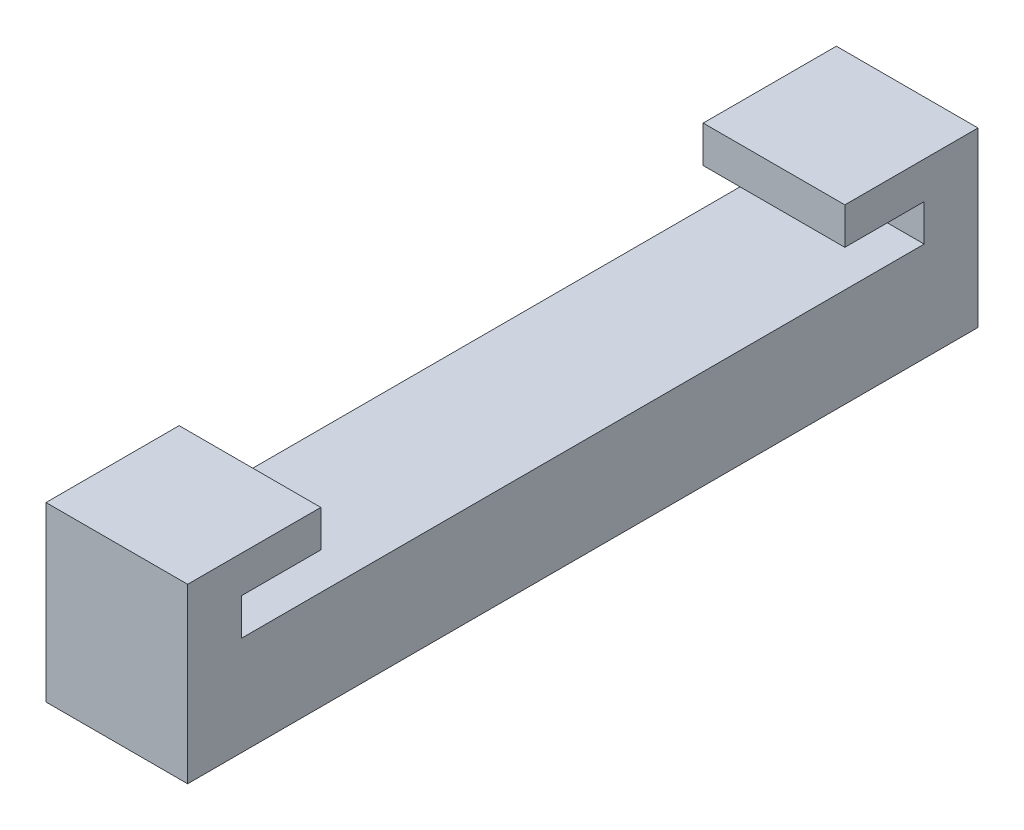
ISO-10303-21;
HEADER;
FILE_DESCRIPTION(('STEP AP214'),'2;1');
FILE_NAME('part.step','',(''),(''),'','','');
FILE_SCHEMA(('AUTOMOTIVE_DESIGN { 1 0 10303 214 1 1 1 1 }'));
ENDSEC;
DATA;
#1=APPLICATION_CONTEXT('core data for automotive mechanical design processes');
#2=APPLICATION_PROTOCOL_DEFINITION('international standard','automotive_design',2000,#1);
#3=PRODUCT_CONTEXT('',#1,'mechanical');
#4=PRODUCT('Part','Part','',(#3));
#5=PRODUCT_RELATED_PRODUCT_CATEGORY('part','',(#4));
#6=PRODUCT_DEFINITION_FORMATION('','',#4);
#7=PRODUCT_DEFINITION_CONTEXT('part definition',#1,'design');
#8=PRODUCT_DEFINITION('design','',#6,#7);
#9=PRODUCT_DEFINITION_SHAPE('','',#8);
#10=(LENGTH_UNIT() NAMED_UNIT(*) SI_UNIT(.MILLI.,.METRE.));
#11=(NAMED_UNIT(*) PLANE_ANGLE_UNIT() SI_UNIT($,.RADIAN.));
#12=(NAMED_UNIT(*) SI_UNIT($,.STERADIAN.) SOLID_ANGLE_UNIT());
#13=UNCERTAINTY_MEASURE_WITH_UNIT(LENGTH_MEASURE(1.E-05),#10,'distance_accuracy_value','');
#14=(GEOMETRIC_REPRESENTATION_CONTEXT(3) GLOBAL_UNCERTAINTY_ASSIGNED_CONTEXT((#13)) GLOBAL_UNIT_ASSIGNED_CONTEXT((#10,
#11,#12)) REPRESENTATION_CONTEXT('',''));
#15=CARTESIAN_POINT('',(0.,0.,0.));
#16=DIRECTION('',(0.,0.,1.));
#17=DIRECTION('',(1.,0.,0.));
#18=AXIS2_PLACEMENT_3D('',#15,#16,#17);
#19=CARTESIAN_POINT('',(12.7,12.192,-63.5));
#20=DIRECTION('',(0.,-1.,0.));
#21=DIRECTION('',(0.,0.,-1.));
#22=AXIS2_PLACEMENT_3D('',#19,#20,#21);
#23=PLANE('',#22);
#24=DIRECTION('',(-1.,0.,0.));
#25=VECTOR('',#24,1.);
#26=CARTESIAN_POINT('',(12.7,12.192,-70.612));
#27=LINE('',#26,#25);
#28=CARTESIAN_POINT('',(12.7,12.192,-70.612));
#29=VERTEX_POINT('',#28);
#30=CARTESIAN_POINT('',(0.,12.192,-70.612));
#31=VERTEX_POINT('',#30);
#32=EDGE_CURVE('E78',#29,#31,#27,.T.);
#33=ORIENTED_EDGE('',*,*,#32,.F.);
#34=DIRECTION('',(0.,0.,1.));
#35=VECTOR('',#34,1.);
#36=CARTESIAN_POINT('',(12.7,12.192,-63.5));
#37=LINE('',#36,#35);
#38=CARTESIAN_POINT('',(12.7,12.192,-63.5));
#39=VERTEX_POINT('',#38);
#40=EDGE_CURVE('E226',#29,#39,#37,.T.);
#41=ORIENTED_EDGE('',*,*,#40,.T.);
#42=DIRECTION('',(-1.,0.,0.));
#43=VECTOR('',#42,1.);
#44=CARTESIAN_POINT('',(12.7,12.192,-63.5));
#45=LINE('',#44,#43);
#46=CARTESIAN_POINT('',(0.,12.192,-63.5));
#47=VERTEX_POINT('',#46);
#48=EDGE_CURVE('E90',#39,#47,#45,.T.);
#49=ORIENTED_EDGE('',*,*,#48,.T.);
#50=DIRECTION('',(0.,0.,1.));
#51=VECTOR('',#50,1.);
#52=CARTESIAN_POINT('',(0.,12.192,-63.5));
#53=LINE('',#52,#51);
#54=EDGE_CURVE('E99',#31,#47,#53,.T.);
#55=ORIENTED_EDGE('',*,*,#54,.F.);
#56=EDGE_LOOP('',(#33,#41,#49,#55));
#57=FACE_BOUND('',#56,.T.);
#58=ADVANCED_FACE('F33',(#57),#23,.T.);
#59=CARTESIAN_POINT('',(12.7,8.89,-70.612));
#60=DIRECTION('',(0.,0.,1.));
#61=DIRECTION('',(1.,0.,0.));
#62=AXIS2_PLACEMENT_3D('',#59,#60,#61);
#63=PLANE('',#62);
#64=DIRECTION('',(-1.,0.,0.));
#65=VECTOR('',#64,1.);
#66=CARTESIAN_POINT('',(12.7,8.89,-70.612));
#67=LINE('',#66,#65);
#68=CARTESIAN_POINT('',(12.7,8.89,-70.612));
#69=VERTEX_POINT('',#68);
#70=CARTESIAN_POINT('',(0.,8.89,-70.612));
#71=VERTEX_POINT('',#70);
#72=EDGE_CURVE('E91',#69,#71,#67,.T.);
#73=ORIENTED_EDGE('',*,*,#72,.F.);
#74=DIRECTION('',(0.,1.,0.));
#75=VECTOR('',#74,1.);
#76=CARTESIAN_POINT('',(12.7,12.192,-70.612));
#77=LINE('',#76,#75);
#78=EDGE_CURVE('E85',#69,#29,#77,.T.);
#79=ORIENTED_EDGE('',*,*,#78,.T.);
#80=ORIENTED_EDGE('',*,*,#32,.T.);
#81=DIRECTION('',(0.,1.,0.));
#82=VECTOR('',#81,1.);
#83=CARTESIAN_POINT('',(0.,8.89,-70.612));
#84=LINE('',#83,#82);
#85=EDGE_CURVE('E82',#71,#31,#84,.T.);
#86=ORIENTED_EDGE('',*,*,#85,.F.);
#87=EDGE_LOOP('',(#73,#79,#80,#86));
#88=FACE_BOUND('',#87,.T.);
#89=ADVANCED_FACE('F81',(#88),#63,.T.);
#90=CARTESIAN_POINT('',(12.7,0.,0.));
#91=DIRECTION('',(0.,1.,0.));
#92=DIRECTION('',(0.,0.,1.));
#93=AXIS2_PLACEMENT_3D('',#90,#91,#92);
#94=PLANE('',#93);
#95=DIRECTION('',(0.,0.,-1.));
#96=VECTOR('',#95,1.);
#97=CARTESIAN_POINT('',(12.7,0.,0.));
#98=LINE('',#97,#96);
#99=CARTESIAN_POINT('',(12.7,0.,-4.572));
#100=VERTEX_POINT('',#99);
#101=CARTESIAN_POINT('',(12.7,0.,-75.438));
#102=VERTEX_POINT('',#101);
#103=EDGE_CURVE('E42',#100,#102,#98,.T.);
#104=ORIENTED_EDGE('',*,*,#103,.F.);
#105=DIRECTION('',(-1.,0.,0.));
#106=VECTOR('',#105,1.);
#107=CARTESIAN_POINT('',(12.701,0.,-4.572));
#108=LINE('',#107,#106);
#109=CARTESIAN_POINT('',(0.,0.,-4.572));
#110=VERTEX_POINT('',#109);
#111=EDGE_CURVE('E179',#100,#110,#108,.T.);
#112=ORIENTED_EDGE('',*,*,#111,.T.);
#113=DIRECTION('',(0.,0.,-1.));
#114=VECTOR('',#113,1.);
#115=CARTESIAN_POINT('',(0.,0.,0.));
#116=LINE('',#115,#114);
#117=CARTESIAN_POINT('',(0.,0.,-75.438));
#118=VERTEX_POINT('',#117);
#119=EDGE_CURVE('E109',#110,#118,#116,.T.);
#120=ORIENTED_EDGE('',*,*,#119,.T.);
#121=DIRECTION('',(-1.,0.,0.));
#122=VECTOR('',#121,1.);
#123=CARTESIAN_POINT('',(12.701,0.,-75.438));
#124=LINE('',#123,#122);
#125=EDGE_CURVE('E173',#102,#118,#124,.T.);
#126=ORIENTED_EDGE('',*,*,#125,.F.);
#127=EDGE_LOOP('',(#104,#112,#120,#126));
#128=FACE_BOUND('',#127,.T.);
#129=ADVANCED_FACE('F35',(#128),#94,.F.);
#130=CARTESIAN_POINT('',(12.7,8.89,-71.12));
#131=DIRECTION('',(0.,-1.,0.));
#132=DIRECTION('',(0.,0.,-1.));
#133=AXIS2_PLACEMENT_3D('',#130,#131,#132);
#134=PLANE('',#133);
#135=DIRECTION('',(0.,0.,1.));
#136=VECTOR('',#135,1.);
#137=CARTESIAN_POINT('',(12.7,8.89,-71.12));
#138=LINE('',#137,#136);
#139=CARTESIAN_POINT('',(12.7,8.88999999999999,-9.398));
#140=VERTEX_POINT('',#139);
#141=EDGE_CURVE('E11',#69,#140,#138,.T.);
#142=ORIENTED_EDGE('',*,*,#141,.F.);
#143=ORIENTED_EDGE('',*,*,#72,.T.);
#144=DIRECTION('',(0.,0.,1.));
#145=VECTOR('',#144,1.);
#146=CARTESIAN_POINT('',(0.,8.89,-71.12));
#147=LINE('',#146,#145);
#148=CARTESIAN_POINT('',(0.,8.88999999999999,-9.398));
#149=VERTEX_POINT('',#148);
#150=EDGE_CURVE('E37',#71,#149,#147,.T.);
#151=ORIENTED_EDGE('',*,*,#150,.T.);
#152=DIRECTION('',(-1.,0.,0.));
#153=VECTOR('',#152,1.);
#154=CARTESIAN_POINT('',(12.7,8.88999999999999,-9.398));
#155=LINE('',#154,#153);
#156=EDGE_CURVE('E50',#140,#149,#155,.T.);
#157=ORIENTED_EDGE('',*,*,#156,.F.);
#158=EDGE_LOOP('',(#142,#143,#151,#157));
#159=FACE_BOUND('',#158,.T.);
#160=ADVANCED_FACE('F123',(#159),#134,.F.);
#161=CARTESIAN_POINT('',(12.7,0.,0.));
#162=DIRECTION('',(1.,0.,0.));
#163=DIRECTION('',(0.,0.,-1.));
#164=AXIS2_PLACEMENT_3D('',#161,#162,#163);
#165=PLANE('',#164);
#166=ORIENTED_EDGE('',*,*,#78,.F.);
#167=ORIENTED_EDGE('',*,*,#141,.T.);
#168=DIRECTION('',(0.,-1.,0.));
#169=VECTOR('',#168,1.);
#170=CARTESIAN_POINT('',(12.7,12.192,-9.398));
#171=LINE('',#170,#169);
#172=CARTESIAN_POINT('',(12.7,12.192,-9.398));
#173=VERTEX_POINT('',#172);
#174=EDGE_CURVE('E232',#173,#140,#171,.T.);
#175=ORIENTED_EDGE('',*,*,#174,.F.);
#176=DIRECTION('',(0.,0.,1.));
#177=VECTOR('',#176,1.);
#178=CARTESIAN_POINT('',(12.7,12.192,-16.51));
#179=LINE('',#178,#177);
#180=CARTESIAN_POINT('',(12.7,12.192,-16.51));
#181=VERTEX_POINT('',#180);
#182=EDGE_CURVE('E228',#181,#173,#179,.T.);
#183=ORIENTED_EDGE('',*,*,#182,.F.);
#184=DIRECTION('',(0.,-1.,0.));
#185=VECTOR('',#184,1.);
#186=CARTESIAN_POINT('',(12.7,12.192,-16.51));
#187=LINE('',#186,#185);
#188=CARTESIAN_POINT('',(12.7,15.494,-16.51));
#189=VERTEX_POINT('',#188);
#190=EDGE_CURVE('E135',#189,#181,#187,.T.);
#191=ORIENTED_EDGE('',*,*,#190,.F.);
#192=DIRECTION('',(0.,0.,-1.));
#193=VECTOR('',#192,1.);
#194=CARTESIAN_POINT('',(12.7,15.494,-16.51));
#195=LINE('',#194,#193);
#196=CARTESIAN_POINT('',(12.7,15.494,-4.572));
#197=VERTEX_POINT('',#196);
#198=EDGE_CURVE('E151',#197,#189,#195,.T.);
#199=ORIENTED_EDGE('',*,*,#198,.F.);
#200=DIRECTION('',(0.,-1.,0.));
#201=VECTOR('',#200,1.);
#202=CARTESIAN_POINT('',(12.7,15.494,-4.572));
#203=LINE('',#202,#201);
#204=EDGE_CURVE('E234',#197,#100,#203,.T.);
#205=ORIENTED_EDGE('',*,*,#204,.T.);
#206=ORIENTED_EDGE('',*,*,#103,.T.);
#207=DIRECTION('',(0.,1.,0.));
#208=VECTOR('',#207,1.);
#209=CARTESIAN_POINT('',(12.7,15.494,-75.438));
#210=LINE('',#209,#208);
#211=CARTESIAN_POINT('',(12.7,15.494,-75.438));
#212=VERTEX_POINT('',#211);
#213=EDGE_CURVE('E176',#102,#212,#210,.T.);
#214=ORIENTED_EDGE('',*,*,#213,.T.);
#215=DIRECTION('',(0.,0.,-1.));
#216=VECTOR('',#215,1.);
#217=CARTESIAN_POINT('',(12.7,15.494,-63.5));
#218=LINE('',#217,#216);
#219=CARTESIAN_POINT('',(12.7,15.494,-63.5));
#220=VERTEX_POINT('',#219);
#221=EDGE_CURVE('E105',#220,#212,#218,.T.);
#222=ORIENTED_EDGE('',*,*,#221,.F.);
#223=DIRECTION('',(0.,1.,0.));
#224=VECTOR('',#223,1.);
#225=CARTESIAN_POINT('',(12.7,12.192,-63.5));
#226=LINE('',#225,#224);
#227=EDGE_CURVE('E59',#39,#220,#226,.T.);
#228=ORIENTED_EDGE('',*,*,#227,.F.);
#229=ORIENTED_EDGE('',*,*,#40,.F.);
#230=EDGE_LOOP('',(#166,#167,#175,#183,#191,#199,#205,#206,#214,#222,#228,#229));
#231=FACE_BOUND('',#230,.T.);
#232=ADVANCED_FACE('F225',(#231),#165,.T.);
#233=CARTESIAN_POINT('',(0.,0.,0.));
#234=DIRECTION('',(1.,0.,0.));
#235=DIRECTION('',(0.,0.,-1.));
#236=AXIS2_PLACEMENT_3D('',#233,#234,#235);
#237=PLANE('',#236);
#238=ORIENTED_EDGE('',*,*,#119,.F.);
#239=DIRECTION('',(0.,-1.,0.));
#240=VECTOR('',#239,1.);
#241=CARTESIAN_POINT('',(0.,15.494,-4.572));
#242=LINE('',#241,#240);
#243=CARTESIAN_POINT('',(0.,15.494,-4.572));
#244=VERTEX_POINT('',#243);
#245=EDGE_CURVE('E237',#244,#110,#242,.T.);
#246=ORIENTED_EDGE('',*,*,#245,.F.);
#247=DIRECTION('',(0.,0.,-1.));
#248=VECTOR('',#247,1.);
#249=CARTESIAN_POINT('',(0.,15.494,-16.51));
#250=LINE('',#249,#248);
#251=CARTESIAN_POINT('',(0.,15.494,-16.51));
#252=VERTEX_POINT('',#251);
#253=EDGE_CURVE('E132',#244,#252,#250,.T.);
#254=ORIENTED_EDGE('',*,*,#253,.T.);
#255=DIRECTION('',(0.,-1.,0.));
#256=VECTOR('',#255,1.);
#257=CARTESIAN_POINT('',(0.,12.192,-16.51));
#258=LINE('',#257,#256);
#259=CARTESIAN_POINT('',(0.,12.192,-16.51));
#260=VERTEX_POINT('',#259);
#261=EDGE_CURVE('E137',#252,#260,#258,.T.);
#262=ORIENTED_EDGE('',*,*,#261,.T.);
#263=DIRECTION('',(0.,0.,1.));
#264=VECTOR('',#263,1.);
#265=CARTESIAN_POINT('',(0.,12.192,-16.51));
#266=LINE('',#265,#264);
#267=CARTESIAN_POINT('',(0.,12.192,-9.398));
#268=VERTEX_POINT('',#267);
#269=EDGE_CURVE('E130',#260,#268,#266,.T.);
#270=ORIENTED_EDGE('',*,*,#269,.T.);
#271=DIRECTION('',(0.,-1.,0.));
#272=VECTOR('',#271,1.);
#273=CARTESIAN_POINT('',(0.,8.88999999999999,-9.398));
#274=LINE('',#273,#272);
#275=EDGE_CURVE('E126',#268,#149,#274,.T.);
#276=ORIENTED_EDGE('',*,*,#275,.T.);
#277=ORIENTED_EDGE('',*,*,#150,.F.);
#278=ORIENTED_EDGE('',*,*,#85,.T.);
#279=ORIENTED_EDGE('',*,*,#54,.T.);
#280=DIRECTION('',(0.,1.,0.));
#281=VECTOR('',#280,1.);
#282=CARTESIAN_POINT('',(0.,12.192,-63.5));
#283=LINE('',#282,#281);
#284=CARTESIAN_POINT('',(0.,15.494,-63.5));
#285=VERTEX_POINT('',#284);
#286=EDGE_CURVE('E144',#47,#285,#283,.T.);
#287=ORIENTED_EDGE('',*,*,#286,.T.);
#288=DIRECTION('',(0.,0.,-1.));
#289=VECTOR('',#288,1.);
#290=CARTESIAN_POINT('',(0.,15.494,-63.5));
#291=LINE('',#290,#289);
#292=CARTESIAN_POINT('',(0.,15.494,-75.438));
#293=VERTEX_POINT('',#292);
#294=EDGE_CURVE('E101',#285,#293,#291,.T.);
#295=ORIENTED_EDGE('',*,*,#294,.T.);
#296=DIRECTION('',(0.,1.,0.));
#297=VECTOR('',#296,1.);
#298=CARTESIAN_POINT('',(0.,15.494,-75.438));
#299=LINE('',#298,#297);
#300=EDGE_CURVE('E161',#118,#293,#299,.T.);
#301=ORIENTED_EDGE('',*,*,#300,.F.);
#302=EDGE_LOOP('',(#238,#246,#254,#262,#270,#276,#277,#278,#279,#287,#295,#301));
#303=FACE_BOUND('',#302,.T.);
#304=ADVANCED_FACE('F97',(#303),#237,.F.);
#305=CARTESIAN_POINT('',(12.7,15.494,-63.5));
#306=DIRECTION('',(0.,1.,0.));
#307=DIRECTION('',(0.,0.,1.));
#308=AXIS2_PLACEMENT_3D('',#305,#306,#307);
#309=PLANE('',#308);
#310=ORIENTED_EDGE('',*,*,#221,.T.);
#311=DIRECTION('',(-1.,0.,0.));
#312=VECTOR('',#311,1.);
#313=CARTESIAN_POINT('',(12.701,15.494,-75.438));
#314=LINE('',#313,#312);
#315=EDGE_CURVE('E166',#212,#293,#314,.T.);
#316=ORIENTED_EDGE('',*,*,#315,.T.);
#317=ORIENTED_EDGE('',*,*,#294,.F.);
#318=DIRECTION('',(-1.,0.,0.));
#319=VECTOR('',#318,1.);
#320=CARTESIAN_POINT('',(12.7,15.494,-63.5));
#321=LINE('',#320,#319);
#322=EDGE_CURVE('E112',#220,#285,#321,.T.);
#323=ORIENTED_EDGE('',*,*,#322,.F.);
#324=EDGE_LOOP('',(#310,#316,#317,#323));
#325=FACE_BOUND('',#324,.T.);
#326=ADVANCED_FACE('F167',(#325),#309,.T.);
#327=CARTESIAN_POINT('',(12.7,12.192,-63.5));
#328=DIRECTION('',(0.,0.,1.));
#329=DIRECTION('',(1.,0.,0.));
#330=AXIS2_PLACEMENT_3D('',#327,#328,#329);
#331=PLANE('',#330);
#332=ORIENTED_EDGE('',*,*,#48,.F.);
#333=ORIENTED_EDGE('',*,*,#227,.T.);
#334=ORIENTED_EDGE('',*,*,#322,.T.);
#335=ORIENTED_EDGE('',*,*,#286,.F.);
#336=EDGE_LOOP('',(#332,#333,#334,#335));
#337=FACE_BOUND('',#336,.T.);
#338=ADVANCED_FACE('F269',(#337),#331,.T.);
#339=CARTESIAN_POINT('',(12.7,15.494,-16.51));
#340=DIRECTION('',(0.,1.,0.));
#341=DIRECTION('',(0.,0.,1.));
#342=AXIS2_PLACEMENT_3D('',#339,#340,#341);
#343=PLANE('',#342);
#344=ORIENTED_EDGE('',*,*,#253,.F.);
#345=DIRECTION('',(-1.,0.,0.));
#346=VECTOR('',#345,1.);
#347=CARTESIAN_POINT('',(12.701,15.494,-4.572));
#348=LINE('',#347,#346);
#349=EDGE_CURVE('E239',#197,#244,#348,.T.);
#350=ORIENTED_EDGE('',*,*,#349,.F.);
#351=ORIENTED_EDGE('',*,*,#198,.T.);
#352=DIRECTION('',(-1.,0.,0.));
#353=VECTOR('',#352,1.);
#354=CARTESIAN_POINT('',(12.7,15.494,-16.51));
#355=LINE('',#354,#353);
#356=EDGE_CURVE('E141',#189,#252,#355,.T.);
#357=ORIENTED_EDGE('',*,*,#356,.T.);
#358=EDGE_LOOP('',(#344,#350,#351,#357));
#359=FACE_BOUND('',#358,.T.);
#360=ADVANCED_FACE('F246',(#359),#343,.T.);
#361=CARTESIAN_POINT('',(12.7,12.192,-16.51));
#362=DIRECTION('',(0.,0.,-1.));
#363=DIRECTION('',(-1.,0.,0.));
#364=AXIS2_PLACEMENT_3D('',#361,#362,#363);
#365=PLANE('',#364);
#366=ORIENTED_EDGE('',*,*,#190,.T.);
#367=DIRECTION('',(-1.,0.,0.));
#368=VECTOR('',#367,1.);
#369=CARTESIAN_POINT('',(12.7,12.192,-16.51));
#370=LINE('',#369,#368);
#371=EDGE_CURVE('E149',#181,#260,#370,.T.);
#372=ORIENTED_EDGE('',*,*,#371,.T.);
#373=ORIENTED_EDGE('',*,*,#261,.F.);
#374=ORIENTED_EDGE('',*,*,#356,.F.);
#375=EDGE_LOOP('',(#366,#372,#373,#374));
#376=FACE_BOUND('',#375,.T.);
#377=ADVANCED_FACE('F192',(#376),#365,.T.);
#378=CARTESIAN_POINT('',(12.7,8.88999999999999,-9.398));
#379=DIRECTION('',(0.,0.,-1.));
#380=DIRECTION('',(-1.,0.,0.));
#381=AXIS2_PLACEMENT_3D('',#378,#379,#380);
#382=PLANE('',#381);
#383=DIRECTION('',(-1.,0.,0.));
#384=VECTOR('',#383,1.);
#385=CARTESIAN_POINT('',(12.7,12.192,-9.398));
#386=LINE('',#385,#384);
#387=EDGE_CURVE('E146',#173,#268,#386,.T.);
#388=ORIENTED_EDGE('',*,*,#387,.F.);
#389=ORIENTED_EDGE('',*,*,#174,.T.);
#390=ORIENTED_EDGE('',*,*,#156,.T.);
#391=ORIENTED_EDGE('',*,*,#275,.F.);
#392=EDGE_LOOP('',(#388,#389,#390,#391));
#393=FACE_BOUND('',#392,.T.);
#394=ADVANCED_FACE('F251',(#393),#382,.T.);
#395=CARTESIAN_POINT('',(12.7,12.192,-16.51));
#396=DIRECTION('',(0.,-1.,0.));
#397=DIRECTION('',(0.,0.,-1.));
#398=AXIS2_PLACEMENT_3D('',#395,#396,#397);
#399=PLANE('',#398);
#400=ORIENTED_EDGE('',*,*,#371,.F.);
#401=ORIENTED_EDGE('',*,*,#182,.T.);
#402=ORIENTED_EDGE('',*,*,#387,.T.);
#403=ORIENTED_EDGE('',*,*,#269,.F.);
#404=EDGE_LOOP('',(#400,#401,#402,#403));
#405=FACE_BOUND('',#404,.T.);
#406=ADVANCED_FACE('F249',(#405),#399,.T.);
#407=CARTESIAN_POINT('',(12.701,15.494,-75.438));
#408=DIRECTION('',(0.,0.,1.));
#409=DIRECTION('',(1.,0.,0.));
#410=AXIS2_PLACEMENT_3D('',#407,#408,#409);
#411=PLANE('',#410);
#412=ORIENTED_EDGE('',*,*,#125,.T.);
#413=ORIENTED_EDGE('',*,*,#300,.T.);
#414=ORIENTED_EDGE('',*,*,#315,.F.);
#415=ORIENTED_EDGE('',*,*,#213,.F.);
#416=EDGE_LOOP('',(#412,#413,#414,#415));
#417=FACE_BOUND('',#416,.T.);
#418=ADVANCED_FACE('F175',(#417),#411,.F.);
#419=CARTESIAN_POINT('',(12.701,15.494,-4.572));
#420=DIRECTION('',(0.,0.,-1.));
#421=DIRECTION('',(0.,1.,0.));
#422=AXIS2_PLACEMENT_3D('',#419,#420,#421);
#423=PLANE('',#422);
#424=ORIENTED_EDGE('',*,*,#349,.T.);
#425=ORIENTED_EDGE('',*,*,#245,.T.);
#426=ORIENTED_EDGE('',*,*,#111,.F.);
#427=ORIENTED_EDGE('',*,*,#204,.F.);
#428=EDGE_LOOP('',(#424,#425,#426,#427));
#429=FACE_BOUND('',#428,.T.);
#430=ADVANCED_FACE('F244',(#429),#423,.F.);
#431=CLOSED_SHELL('',(#58,#89,#129,#160,#232,#304,#326,#338,#360,#377,#394,#406,#418,#430));
#432=MANIFOLD_SOLID_BREP('B2',#431);
#433=ADVANCED_BREP_SHAPE_REPRESENTATION('',(#18,#432),#14);
#434=SHAPE_DEFINITION_REPRESENTATION(#9,#433);
ENDSEC;
END-ISO-10303-21;
